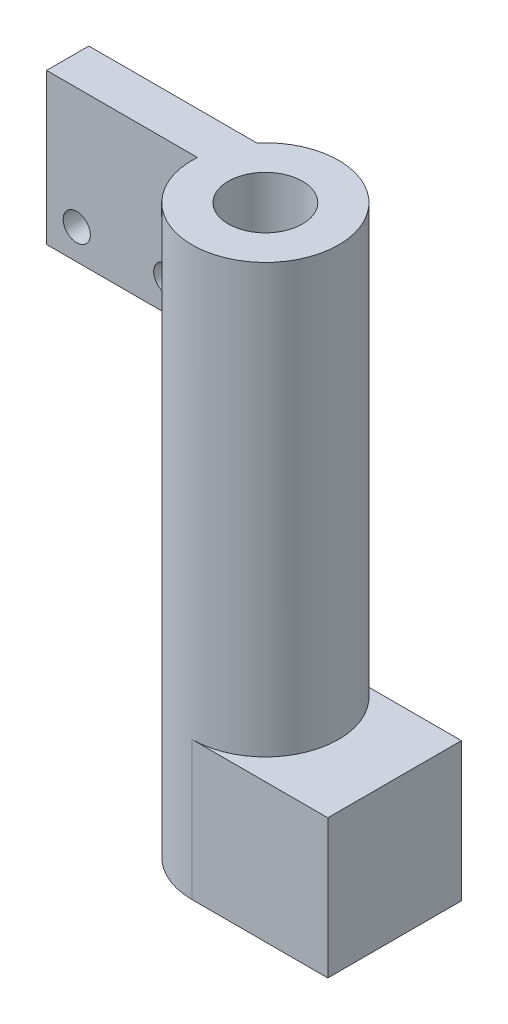
ISO-10303-21;
HEADER;
FILE_DESCRIPTION(('STEP AP214'),'2;1');
FILE_NAME('part.step','',(''),(''),'','','');
FILE_SCHEMA(('AUTOMOTIVE_DESIGN { 1 0 10303 214 1 1 1 1 }'));
ENDSEC;
DATA;
#1=APPLICATION_CONTEXT('core data for automotive mechanical design processes');
#2=APPLICATION_PROTOCOL_DEFINITION('international standard','automotive_design',2000,#1);
#3=PRODUCT_CONTEXT('',#1,'mechanical');
#4=PRODUCT('Part','Part','',(#3));
#5=PRODUCT_RELATED_PRODUCT_CATEGORY('part','',(#4));
#6=PRODUCT_DEFINITION_FORMATION('','',#4);
#7=PRODUCT_DEFINITION_CONTEXT('part definition',#1,'design');
#8=PRODUCT_DEFINITION('design','',#6,#7);
#9=PRODUCT_DEFINITION_SHAPE('','',#8);
#10=(LENGTH_UNIT() NAMED_UNIT(*) SI_UNIT(.MILLI.,.METRE.));
#11=(NAMED_UNIT(*) PLANE_ANGLE_UNIT() SI_UNIT($,.RADIAN.));
#12=(NAMED_UNIT(*) SI_UNIT($,.STERADIAN.) SOLID_ANGLE_UNIT());
#13=UNCERTAINTY_MEASURE_WITH_UNIT(LENGTH_MEASURE(1.E-05),#10,'distance_accuracy_value','');
#14=(GEOMETRIC_REPRESENTATION_CONTEXT(3) GLOBAL_UNCERTAINTY_ASSIGNED_CONTEXT((#13)) GLOBAL_UNIT_ASSIGNED_CONTEXT((#10,
#11,#12)) REPRESENTATION_CONTEXT('',''));
#15=CARTESIAN_POINT('',(0.,0.,0.));
#16=DIRECTION('',(0.,0.,1.));
#17=DIRECTION('',(1.,0.,0.));
#18=AXIS2_PLACEMENT_3D('',#15,#16,#17);
#19=CARTESIAN_POINT('',(0.,94.,0.));
#20=DIRECTION('',(0.,1.,0.));
#21=DIRECTION('',(0.,0.,1.));
#22=AXIS2_PLACEMENT_3D('',#19,#20,#21);
#23=PLANE('',#22);
#24=CARTESIAN_POINT('',(0.,94.,0.));
#25=DIRECTION('',(0.,1.,0.));
#26=DIRECTION('',(1.,0.,0.));
#27=AXIS2_PLACEMENT_3D('',#24,#25,#26);
#28=CIRCLE('',#27,12.15);
#29=CARTESIAN_POINT('',(-12.1202310209006,94.,-0.849999999999998));
#30=VERTEX_POINT('',#29);
#31=CARTESIAN_POINT('',(-9.27361849549571,94.,-7.84999999999999));
#32=VERTEX_POINT('',#31);
#33=EDGE_CURVE('E59',#30,#32,#28,.T.);
#34=ORIENTED_EDGE('',*,*,#33,.T.);
#35=DIRECTION('',(-1.,0.,0.));
#36=VECTOR('',#35,1.);
#37=CARTESIAN_POINT('',(-37.1202310209005,94.,-7.85));
#38=LINE('',#37,#36);
#39=CARTESIAN_POINT('',(-37.1202310209005,94.,-7.85));
#40=VERTEX_POINT('',#39);
#41=EDGE_CURVE('E154',#32,#40,#38,.T.);
#42=ORIENTED_EDGE('',*,*,#41,.T.);
#43=DIRECTION('',(0.,0.,1.));
#44=VECTOR('',#43,1.);
#45=CARTESIAN_POINT('',(-37.1202310209005,94.,-0.849999999999995));
#46=LINE('',#45,#44);
#47=CARTESIAN_POINT('',(-37.1202310209005,94.,-0.849999999999995));
#48=VERTEX_POINT('',#47);
#49=EDGE_CURVE('E175',#40,#48,#46,.T.);
#50=ORIENTED_EDGE('',*,*,#49,.T.);
#51=DIRECTION('',(1.,0.,0.));
#52=VECTOR('',#51,1.);
#53=CARTESIAN_POINT('',(-12.1202310209006,94.,-0.849999999999998));
#54=LINE('',#53,#52);
#55=EDGE_CURVE('E163',#48,#30,#54,.T.);
#56=ORIENTED_EDGE('',*,*,#55,.T.);
#57=EDGE_LOOP('',(#34,#42,#50,#56));
#58=FACE_BOUND('',#57,.T.);
#59=CARTESIAN_POINT('',(0.,94.,0.));
#60=DIRECTION('',(0.,1.,0.));
#61=DIRECTION('',(0.,0.,1.));
#62=AXIS2_PLACEMENT_3D('',#59,#60,#61);
#63=CIRCLE('',#62,6.15);
#64=CARTESIAN_POINT('',(0.,94.,6.15));
#65=VERTEX_POINT('',#64);
#66=EDGE_CURVE('E115',#65,#65,#63,.T.);
#67=ORIENTED_EDGE('',*,*,#66,.F.);
#68=EDGE_LOOP('',(#67));
#69=FACE_BOUND('',#68,.T.);
#70=ADVANCED_FACE('F51',(#58,#69),#23,.T.);
#71=CARTESIAN_POINT('',(0.,0.,0.));
#72=DIRECTION('',(0.,1.,0.));
#73=DIRECTION('',(0.,0.,1.));
#74=AXIS2_PLACEMENT_3D('',#71,#72,#73);
#75=PLANE('',#74);
#76=CARTESIAN_POINT('',(0.,0.,0.));
#77=DIRECTION('',(0.,1.,0.));
#78=DIRECTION('',(0.,0.,1.));
#79=AXIS2_PLACEMENT_3D('',#76,#77,#78);
#80=CIRCLE('',#79,6.15);
#81=CARTESIAN_POINT('',(0.,0.,6.15));
#82=VERTEX_POINT('',#81);
#83=EDGE_CURVE('E182',#82,#82,#80,.T.);
#84=ORIENTED_EDGE('',*,*,#83,.T.);
#85=EDGE_LOOP('',(#84));
#86=FACE_BOUND('',#85,.T.);
#87=DIRECTION('',(1.,0.,0.));
#88=VECTOR('',#87,1.);
#89=CARTESIAN_POINT('',(0.,0.,12.15));
#90=LINE('',#89,#88);
#91=CARTESIAN_POINT('',(0.,0.,12.15));
#92=VERTEX_POINT('',#91);
#93=CARTESIAN_POINT('',(22.5,0.,12.15));
#94=VERTEX_POINT('',#93);
#95=EDGE_CURVE('E117',#92,#94,#90,.T.);
#96=ORIENTED_EDGE('',*,*,#95,.F.);
#97=CARTESIAN_POINT('',(0.,0.,0.));
#98=DIRECTION('',(0.,1.,0.));
#99=DIRECTION('',(1.,0.,0.));
#100=AXIS2_PLACEMENT_3D('',#97,#98,#99);
#101=CIRCLE('',#100,12.15);
#102=CARTESIAN_POINT('',(6.90090573765502,0.,-10.));
#103=VERTEX_POINT('',#102);
#104=EDGE_CURVE('E111',#103,#92,#101,.T.);
#105=ORIENTED_EDGE('',*,*,#104,.F.);
#106=DIRECTION('',(1.,0.,0.));
#107=VECTOR('',#106,1.);
#108=CARTESIAN_POINT('',(0.,0.,-10.));
#109=LINE('',#108,#107);
#110=CARTESIAN_POINT('',(22.5,0.,-10.));
#111=VERTEX_POINT('',#110);
#112=EDGE_CURVE('E134',#103,#111,#109,.T.);
#113=ORIENTED_EDGE('',*,*,#112,.T.);
#114=DIRECTION('',(0.,0.,1.));
#115=VECTOR('',#114,1.);
#116=CARTESIAN_POINT('',(22.5,0.,-10.));
#117=LINE('',#116,#115);
#118=EDGE_CURVE('E120',#111,#94,#117,.T.);
#119=ORIENTED_EDGE('',*,*,#118,.T.);
#120=EDGE_LOOP('',(#96,#105,#113,#119));
#121=FACE_BOUND('',#120,.T.);
#122=ADVANCED_FACE('F118',(#86,#121),#75,.F.);
#123=CARTESIAN_POINT('',(0.,94.,0.));
#124=DIRECTION('',(0.,-1.,0.));
#125=DIRECTION('',(0.,0.,-1.));
#126=AXIS2_PLACEMENT_3D('',#123,#124,#125);
#127=CYLINDRICAL_SURFACE('',#126,12.15);
#128=ORIENTED_EDGE('',*,*,#33,.F.);
#129=DIRECTION('',(0.,1.,0.));
#130=VECTOR('',#129,1.);
#131=CARTESIAN_POINT('',(-12.1202310209006,69.,-0.849999999999998));
#132=LINE('',#131,#130);
#133=CARTESIAN_POINT('',(-12.1202310209006,69.,-0.849999999999998));
#134=VERTEX_POINT('',#133);
#135=EDGE_CURVE('E179',#134,#30,#132,.T.);
#136=ORIENTED_EDGE('',*,*,#135,.F.);
#137=CARTESIAN_POINT('',(0.,69.,0.));
#138=DIRECTION('',(0.,-1.,0.));
#139=DIRECTION('',(0.,0.,1.));
#140=AXIS2_PLACEMENT_3D('',#137,#138,#139);
#141=CIRCLE('',#140,12.15);
#142=CARTESIAN_POINT('',(-9.27361849549571,69.,-7.84999999999999));
#143=VERTEX_POINT('',#142);
#144=EDGE_CURVE('E159',#134,#143,#141,.T.);
#145=ORIENTED_EDGE('',*,*,#144,.T.);
#146=DIRECTION('',(0.,1.,0.));
#147=VECTOR('',#146,1.);
#148=CARTESIAN_POINT('',(-9.27361849549571,69.,-7.84999999999999));
#149=LINE('',#148,#147);
#150=EDGE_CURVE('E172',#143,#32,#149,.T.);
#151=ORIENTED_EDGE('',*,*,#150,.T.);
#152=EDGE_LOOP('',(#128,#136,#145,#151));
#153=FACE_BOUND('',#152,.T.);
#154=CARTESIAN_POINT('',(0.,23.,0.));
#155=DIRECTION('',(0.,1.,0.));
#156=DIRECTION('',(0.,0.,1.));
#157=AXIS2_PLACEMENT_3D('',#154,#155,#156);
#158=CIRCLE('',#157,12.15);
#159=CARTESIAN_POINT('',(0.,23.,12.15));
#160=VERTEX_POINT('',#159);
#161=CARTESIAN_POINT('',(6.90090573765503,23.,-10.));
#162=VERTEX_POINT('',#161);
#163=EDGE_CURVE('E65',#160,#162,#158,.T.);
#164=ORIENTED_EDGE('',*,*,#163,.T.);
#165=DIRECTION('',(0.,-1.,0.));
#166=VECTOR('',#165,1.);
#167=CARTESIAN_POINT('',(6.90090573765502,94.,-10.));
#168=LINE('',#167,#166);
#169=EDGE_CURVE('E12',#162,#103,#168,.T.);
#170=ORIENTED_EDGE('',*,*,#169,.T.);
#171=ORIENTED_EDGE('',*,*,#104,.T.);
#172=DIRECTION('',(0.,-1.,0.));
#173=VECTOR('',#172,1.);
#174=CARTESIAN_POINT('',(0.,0.,12.15));
#175=LINE('',#174,#173);
#176=EDGE_CURVE('E70',#160,#92,#175,.T.);
#177=ORIENTED_EDGE('',*,*,#176,.F.);
#178=EDGE_LOOP('',(#164,#170,#171,#177));
#179=FACE_BOUND('',#178,.T.);
#180=ADVANCED_FACE('F53',(#153,#179),#127,.T.);
#181=CARTESIAN_POINT('',(0.,94.,0.));
#182=DIRECTION('',(0.,-1.,0.));
#183=DIRECTION('',(0.,0.,-1.));
#184=AXIS2_PLACEMENT_3D('',#181,#182,#183);
#185=CYLINDRICAL_SURFACE('',#184,6.15);
#186=ORIENTED_EDGE('',*,*,#83,.F.);
#187=EDGE_LOOP('',(#186));
#188=FACE_BOUND('',#187,.T.);
#189=ORIENTED_EDGE('',*,*,#66,.T.);
#190=EDGE_LOOP('',(#189));
#191=FACE_BOUND('',#190,.T.);
#192=ADVANCED_FACE('F213',(#188,#191),#185,.F.);
#193=CARTESIAN_POINT('',(-12.1202310209006,69.,-0.849999999999998));
#194=DIRECTION('',(0.,0.,1.));
#195=DIRECTION('',(1.,0.,0.));
#196=AXIS2_PLACEMENT_3D('',#193,#194,#195);
#197=PLANE('',#196);
#198=CARTESIAN_POINT('',(-17.1202310209006,74.,-0.849999999999999));
#199=DIRECTION('',(0.,0.,1.));
#200=DIRECTION('',(1.,0.,0.));
#201=AXIS2_PLACEMENT_3D('',#198,#199,#200);
#202=CIRCLE('',#201,2.25);
#203=CARTESIAN_POINT('',(-14.8702310209005,74.,-0.849999999999999));
#204=VERTEX_POINT('',#203);
#205=EDGE_CURVE('E147',#204,#204,#202,.T.);
#206=ORIENTED_EDGE('',*,*,#205,.F.);
#207=EDGE_LOOP('',(#206));
#208=FACE_BOUND('',#207,.T.);
#209=CARTESIAN_POINT('',(-32.1202310209006,74.,-0.849999999999999));
#210=DIRECTION('',(0.,0.,1.));
#211=DIRECTION('',(1.,0.,0.));
#212=AXIS2_PLACEMENT_3D('',#209,#210,#211);
#213=CIRCLE('',#212,2.25);
#214=CARTESIAN_POINT('',(-29.8702310209005,74.,-0.849999999999999));
#215=VERTEX_POINT('',#214);
#216=EDGE_CURVE('E151',#215,#215,#213,.T.);
#217=ORIENTED_EDGE('',*,*,#216,.F.);
#218=EDGE_LOOP('',(#217));
#219=FACE_BOUND('',#218,.T.);
#220=ORIENTED_EDGE('',*,*,#55,.F.);
#221=DIRECTION('',(0.,1.,0.));
#222=VECTOR('',#221,1.);
#223=CARTESIAN_POINT('',(-37.1202310209005,69.,-0.849999999999995));
#224=LINE('',#223,#222);
#225=CARTESIAN_POINT('',(-37.1202310209005,69.,-0.849999999999995));
#226=VERTEX_POINT('',#225);
#227=EDGE_CURVE('E183',#226,#48,#224,.T.);
#228=ORIENTED_EDGE('',*,*,#227,.F.);
#229=DIRECTION('',(1.,0.,0.));
#230=VECTOR('',#229,1.);
#231=CARTESIAN_POINT('',(-12.1202310209006,69.,-0.849999999999998));
#232=LINE('',#231,#230);
#233=EDGE_CURVE('E169',#226,#134,#232,.T.);
#234=ORIENTED_EDGE('',*,*,#233,.T.);
#235=ORIENTED_EDGE('',*,*,#135,.T.);
#236=EDGE_LOOP('',(#220,#228,#234,#235));
#237=FACE_BOUND('',#236,.T.);
#238=ADVANCED_FACE('F211',(#208,#219,#237),#197,.T.);
#239=CARTESIAN_POINT('',(-37.1202310209005,69.,-0.849999999999995));
#240=DIRECTION('',(-1.,0.,0.));
#241=DIRECTION('',(0.,0.,1.));
#242=AXIS2_PLACEMENT_3D('',#239,#240,#241);
#243=PLANE('',#242);
#244=ORIENTED_EDGE('',*,*,#49,.F.);
#245=DIRECTION('',(0.,1.,0.));
#246=VECTOR('',#245,1.);
#247=CARTESIAN_POINT('',(-37.1202310209005,69.,-7.85));
#248=LINE('',#247,#246);
#249=CARTESIAN_POINT('',(-37.1202310209005,69.,-7.85));
#250=VERTEX_POINT('',#249);
#251=EDGE_CURVE('E185',#250,#40,#248,.T.);
#252=ORIENTED_EDGE('',*,*,#251,.F.);
#253=DIRECTION('',(0.,0.,1.));
#254=VECTOR('',#253,1.);
#255=CARTESIAN_POINT('',(-37.1202310209005,69.,-0.849999999999995));
#256=LINE('',#255,#254);
#257=EDGE_CURVE('E166',#250,#226,#256,.T.);
#258=ORIENTED_EDGE('',*,*,#257,.T.);
#259=ORIENTED_EDGE('',*,*,#227,.T.);
#260=EDGE_LOOP('',(#244,#252,#258,#259));
#261=FACE_BOUND('',#260,.T.);
#262=ADVANCED_FACE('F209',(#261),#243,.T.);
#263=CARTESIAN_POINT('',(-37.1202310209005,69.,-7.85));
#264=DIRECTION('',(0.,0.,-1.));
#265=DIRECTION('',(-1.,0.,0.));
#266=AXIS2_PLACEMENT_3D('',#263,#264,#265);
#267=PLANE('',#266);
#268=CARTESIAN_POINT('',(-17.1202310209006,74.,-7.85));
#269=DIRECTION('',(0.,0.,-1.));
#270=DIRECTION('',(-1.,0.,0.));
#271=AXIS2_PLACEMENT_3D('',#268,#269,#270);
#272=CIRCLE('',#271,2.25);
#273=CARTESIAN_POINT('',(-19.3702310209006,74.,-7.85));
#274=VERTEX_POINT('',#273);
#275=EDGE_CURVE('E150',#274,#274,#272,.F.);
#276=ORIENTED_EDGE('',*,*,#275,.T.);
#277=EDGE_LOOP('',(#276));
#278=FACE_BOUND('',#277,.T.);
#279=CARTESIAN_POINT('',(-32.1202310209006,74.,-7.85));
#280=DIRECTION('',(0.,0.,-1.));
#281=DIRECTION('',(-1.,0.,0.));
#282=AXIS2_PLACEMENT_3D('',#279,#280,#281);
#283=CIRCLE('',#282,2.25);
#284=CARTESIAN_POINT('',(-34.3702310209006,74.,-7.85));
#285=VERTEX_POINT('',#284);
#286=EDGE_CURVE('E146',#285,#285,#283,.F.);
#287=ORIENTED_EDGE('',*,*,#286,.T.);
#288=EDGE_LOOP('',(#287));
#289=FACE_BOUND('',#288,.T.);
#290=ORIENTED_EDGE('',*,*,#41,.F.);
#291=ORIENTED_EDGE('',*,*,#150,.F.);
#292=DIRECTION('',(-1.,0.,0.));
#293=VECTOR('',#292,1.);
#294=CARTESIAN_POINT('',(-37.1202310209005,69.,-7.85));
#295=LINE('',#294,#293);
#296=EDGE_CURVE('E162',#143,#250,#295,.T.);
#297=ORIENTED_EDGE('',*,*,#296,.T.);
#298=ORIENTED_EDGE('',*,*,#251,.T.);
#299=EDGE_LOOP('',(#290,#291,#297,#298));
#300=FACE_BOUND('',#299,.T.);
#301=ADVANCED_FACE('F202',(#278,#289,#300),#267,.T.);
#302=CARTESIAN_POINT('',(0.,69.,0.));
#303=DIRECTION('',(0.,1.,0.));
#304=DIRECTION('',(0.,0.,1.));
#305=AXIS2_PLACEMENT_3D('',#302,#303,#304);
#306=PLANE('',#305);
#307=ORIENTED_EDGE('',*,*,#144,.F.);
#308=ORIENTED_EDGE('',*,*,#233,.F.);
#309=ORIENTED_EDGE('',*,*,#257,.F.);
#310=ORIENTED_EDGE('',*,*,#296,.F.);
#311=EDGE_LOOP('',(#307,#308,#309,#310));
#312=FACE_BOUND('',#311,.T.);
#313=ADVANCED_FACE('F205',(#312),#306,.F.);
#314=CARTESIAN_POINT('',(-32.1202310209006,74.,-14.2139610306789));
#315=DIRECTION('',(0.,0.,1.));
#316=DIRECTION('',(1.,0.,0.));
#317=AXIS2_PLACEMENT_3D('',#314,#315,#316);
#318=CYLINDRICAL_SURFACE('',#317,2.25);
#319=ORIENTED_EDGE('',*,*,#216,.T.);
#320=EDGE_LOOP('',(#319));
#321=FACE_BOUND('',#320,.T.);
#322=ORIENTED_EDGE('',*,*,#286,.F.);
#323=EDGE_LOOP('',(#322));
#324=FACE_BOUND('',#323,.T.);
#325=ADVANCED_FACE('F238',(#321,#324),#318,.F.);
#326=CARTESIAN_POINT('',(-17.1202310209006,74.,-14.2139610306789));
#327=DIRECTION('',(0.,0.,1.));
#328=DIRECTION('',(1.,0.,0.));
#329=AXIS2_PLACEMENT_3D('',#326,#327,#328);
#330=CYLINDRICAL_SURFACE('',#329,2.25);
#331=ORIENTED_EDGE('',*,*,#205,.T.);
#332=EDGE_LOOP('',(#331));
#333=FACE_BOUND('',#332,.T.);
#334=ORIENTED_EDGE('',*,*,#275,.F.);
#335=EDGE_LOOP('',(#334));
#336=FACE_BOUND('',#335,.T.);
#337=ADVANCED_FACE('F244',(#333,#336),#330,.F.);
#338=CARTESIAN_POINT('',(0.,0.,-10.));
#339=DIRECTION('',(0.,0.,-1.));
#340=DIRECTION('',(-1.,0.,0.));
#341=AXIS2_PLACEMENT_3D('',#338,#339,#340);
#342=PLANE('',#341);
#343=ORIENTED_EDGE('',*,*,#169,.F.);
#344=DIRECTION('',(-1.,0.,0.));
#345=VECTOR('',#344,1.);
#346=CARTESIAN_POINT('',(0.,23.,-10.));
#347=LINE('',#346,#345);
#348=CARTESIAN_POINT('',(22.5,23.,-10.));
#349=VERTEX_POINT('',#348);
#350=EDGE_CURVE('E139',#349,#162,#347,.T.);
#351=ORIENTED_EDGE('',*,*,#350,.F.);
#352=DIRECTION('',(0.,1.,0.));
#353=VECTOR('',#352,1.);
#354=CARTESIAN_POINT('',(22.5,0.,-10.));
#355=LINE('',#354,#353);
#356=EDGE_CURVE('E136',#111,#349,#355,.T.);
#357=ORIENTED_EDGE('',*,*,#356,.F.);
#358=ORIENTED_EDGE('',*,*,#112,.F.);
#359=EDGE_LOOP('',(#343,#351,#357,#358));
#360=FACE_BOUND('',#359,.T.);
#361=ADVANCED_FACE('F251',(#360),#342,.T.);
#362=CARTESIAN_POINT('',(0.,23.,-10.));
#363=DIRECTION('',(0.,1.,0.));
#364=DIRECTION('',(0.,0.,1.));
#365=AXIS2_PLACEMENT_3D('',#362,#363,#364);
#366=PLANE('',#365);
#367=ORIENTED_EDGE('',*,*,#163,.F.);
#368=DIRECTION('',(-1.,0.,0.));
#369=VECTOR('',#368,1.);
#370=CARTESIAN_POINT('',(0.,23.,12.15));
#371=LINE('',#370,#369);
#372=CARTESIAN_POINT('',(22.5,23.,12.15));
#373=VERTEX_POINT('',#372);
#374=EDGE_CURVE('E129',#373,#160,#371,.T.);
#375=ORIENTED_EDGE('',*,*,#374,.F.);
#376=DIRECTION('',(0.,0.,1.));
#377=VECTOR('',#376,1.);
#378=CARTESIAN_POINT('',(22.5,23.,-10.));
#379=LINE('',#378,#377);
#380=EDGE_CURVE('E142',#349,#373,#379,.T.);
#381=ORIENTED_EDGE('',*,*,#380,.F.);
#382=ORIENTED_EDGE('',*,*,#350,.T.);
#383=EDGE_LOOP('',(#367,#375,#381,#382));
#384=FACE_BOUND('',#383,.T.);
#385=ADVANCED_FACE('F258',(#384),#366,.T.);
#386=CARTESIAN_POINT('',(22.5,0.,-10.));
#387=DIRECTION('',(1.,0.,0.));
#388=DIRECTION('',(0.,1.,0.));
#389=AXIS2_PLACEMENT_3D('',#386,#387,#388);
#390=PLANE('',#389);
#391=ORIENTED_EDGE('',*,*,#380,.T.);
#392=DIRECTION('',(0.,1.,0.));
#393=VECTOR('',#392,1.);
#394=CARTESIAN_POINT('',(22.5,0.,12.15));
#395=LINE('',#394,#393);
#396=EDGE_CURVE('E124',#94,#373,#395,.T.);
#397=ORIENTED_EDGE('',*,*,#396,.F.);
#398=ORIENTED_EDGE('',*,*,#118,.F.);
#399=ORIENTED_EDGE('',*,*,#356,.T.);
#400=EDGE_LOOP('',(#391,#397,#398,#399));
#401=FACE_BOUND('',#400,.T.);
#402=ADVANCED_FACE('F255',(#401),#390,.T.);
#403=CARTESIAN_POINT('',(0.,0.,12.15));
#404=DIRECTION('',(0.,0.,-1.));
#405=DIRECTION('',(-1.,0.,0.));
#406=AXIS2_PLACEMENT_3D('',#403,#404,#405);
#407=PLANE('',#406);
#408=ORIENTED_EDGE('',*,*,#176,.T.);
#409=ORIENTED_EDGE('',*,*,#95,.T.);
#410=ORIENTED_EDGE('',*,*,#396,.T.);
#411=ORIENTED_EDGE('',*,*,#374,.T.);
#412=EDGE_LOOP('',(#408,#409,#410,#411));
#413=FACE_BOUND('',#412,.T.);
#414=ADVANCED_FACE('F127',(#413),#407,.F.);
#415=CLOSED_SHELL('',(#70,#122,#180,#192,#238,#262,#301,#313,#325,#337,#361,#385,#402,#414));
#416=MANIFOLD_SOLID_BREP('B2',#415);
#417=ADVANCED_BREP_SHAPE_REPRESENTATION('',(#18,#416),#14);
#418=SHAPE_DEFINITION_REPRESENTATION(#9,#417);
ENDSEC;
END-ISO-10303-21;
